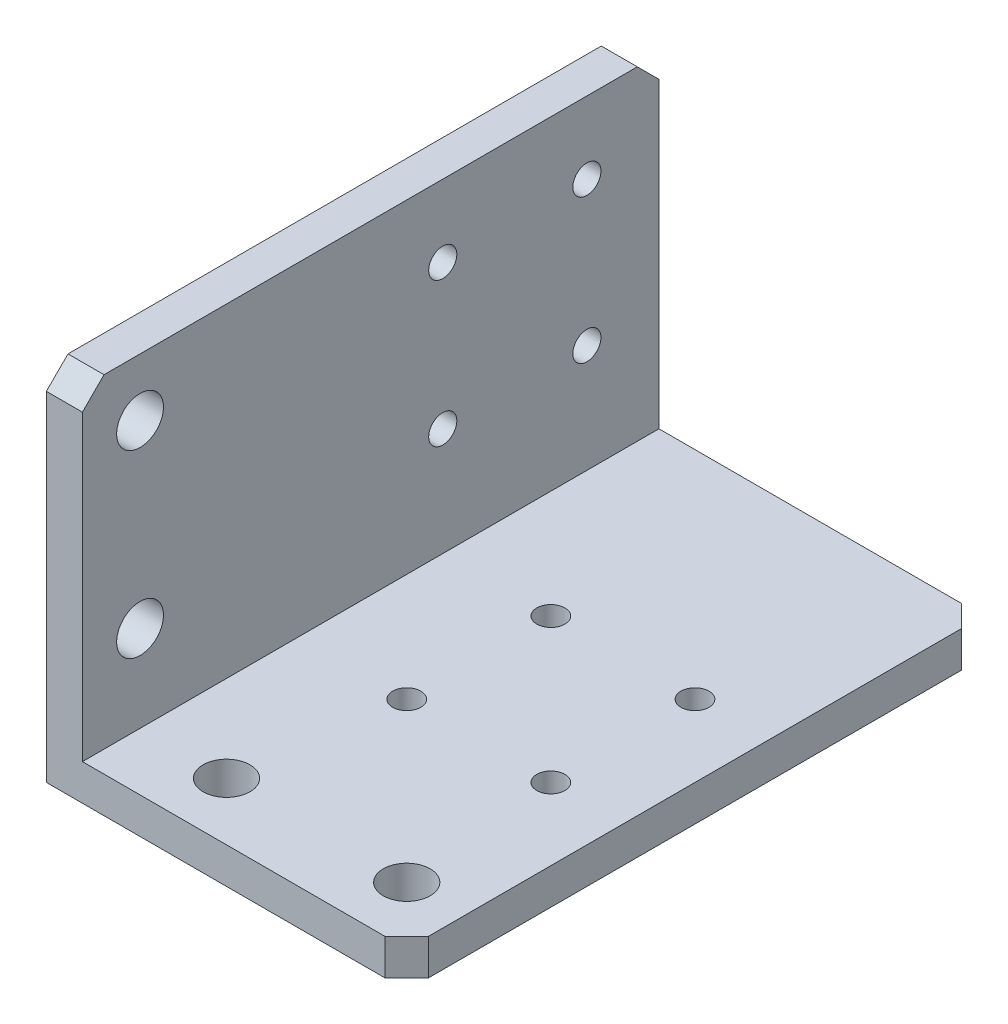
ISO-10303-21;
HEADER;
FILE_DESCRIPTION(('STEP AP214'),'2;1');
FILE_NAME('part.step','',(''),(''),'','','');
FILE_SCHEMA(('AUTOMOTIVE_DESIGN { 1 0 10303 214 1 1 1 1 }'));
ENDSEC;
DATA;
#1=APPLICATION_CONTEXT('core data for automotive mechanical design processes');
#2=APPLICATION_PROTOCOL_DEFINITION('international standard','automotive_design',2000,#1);
#3=PRODUCT_CONTEXT('',#1,'mechanical');
#4=PRODUCT('Part','Part','',(#3));
#5=PRODUCT_RELATED_PRODUCT_CATEGORY('part','',(#4));
#6=PRODUCT_DEFINITION_FORMATION('','',#4);
#7=PRODUCT_DEFINITION_CONTEXT('part definition',#1,'design');
#8=PRODUCT_DEFINITION('design','',#6,#7);
#9=PRODUCT_DEFINITION_SHAPE('','',#8);
#10=(LENGTH_UNIT() NAMED_UNIT(*) SI_UNIT(.MILLI.,.METRE.));
#11=(NAMED_UNIT(*) PLANE_ANGLE_UNIT() SI_UNIT($,.RADIAN.));
#12=(NAMED_UNIT(*) SI_UNIT($,.STERADIAN.) SOLID_ANGLE_UNIT());
#13=UNCERTAINTY_MEASURE_WITH_UNIT(LENGTH_MEASURE(1.E-05),#10,'distance_accuracy_value','');
#14=(GEOMETRIC_REPRESENTATION_CONTEXT(3) GLOBAL_UNCERTAINTY_ASSIGNED_CONTEXT((#13)) GLOBAL_UNIT_ASSIGNED_CONTEXT((#10,
#11,#12)) REPRESENTATION_CONTEXT('',''));
#15=CARTESIAN_POINT('',(0.,0.,0.));
#16=DIRECTION('',(0.,0.,1.));
#17=DIRECTION('',(1.,0.,0.));
#18=AXIS2_PLACEMENT_3D('',#15,#16,#17);
#19=CARTESIAN_POINT('',(50.,0.,80.));
#20=DIRECTION('',(0.,1.,0.));
#21=DIRECTION('',(-1.,0.,0.));
#22=AXIS2_PLACEMENT_3D('',#19,#20,#21);
#23=PLANE('',#22);
#24=CARTESIAN_POINT('',(19.9999999999998,0.,49.9999999999998));
#25=DIRECTION('',(0.,-1.,0.));
#26=DIRECTION('',(0.,0.,-1.));
#27=AXIS2_PLACEMENT_3D('',#24,#25,#26);
#28=CIRCLE('',#27,1.94999999999999);
#29=CARTESIAN_POINT('',(19.9999999999998,0.,48.0499999999999));
#30=VERTEX_POINT('',#29);
#31=EDGE_CURVE('E576',#30,#30,#28,.T.);
#32=ORIENTED_EDGE('',*,*,#31,.F.);
#33=EDGE_LOOP('',(#32));
#34=FACE_BOUND('',#33,.T.);
#35=CARTESIAN_POINT('',(39.9999999999999,0.,50.0000000000001));
#36=DIRECTION('',(0.,-1.,0.));
#37=DIRECTION('',(0.,0.,-1.));
#38=AXIS2_PLACEMENT_3D('',#35,#36,#37);
#39=CIRCLE('',#38,1.94999999999999);
#40=CARTESIAN_POINT('',(39.9999999999999,0.,48.0500000000001));
#41=VERTEX_POINT('',#40);
#42=EDGE_CURVE('E570',#41,#41,#39,.T.);
#43=ORIENTED_EDGE('',*,*,#42,.F.);
#44=EDGE_LOOP('',(#43));
#45=FACE_BOUND('',#44,.T.);
#46=CARTESIAN_POINT('',(40.0000000000001,0.,30.0000000000001));
#47=DIRECTION('',(0.,-1.,0.));
#48=DIRECTION('',(0.,0.,-1.));
#49=AXIS2_PLACEMENT_3D('',#46,#47,#48);
#50=CIRCLE('',#49,1.94999999999999);
#51=CARTESIAN_POINT('',(40.0000000000001,0.,28.0500000000001));
#52=VERTEX_POINT('',#51);
#53=EDGE_CURVE('E564',#52,#52,#50,.T.);
#54=ORIENTED_EDGE('',*,*,#53,.F.);
#55=EDGE_LOOP('',(#54));
#56=FACE_BOUND('',#55,.T.);
#57=CARTESIAN_POINT('',(20.0000000000002,0.,29.9999999999998));
#58=DIRECTION('',(0.,-1.,0.));
#59=DIRECTION('',(0.,0.,-1.));
#60=AXIS2_PLACEMENT_3D('',#57,#58,#59);
#61=CIRCLE('',#60,1.94999999999999);
#62=CARTESIAN_POINT('',(20.0000000000002,0.,28.0499999999998));
#63=VERTEX_POINT('',#62);
#64=EDGE_CURVE('E558',#63,#63,#61,.T.);
#65=ORIENTED_EDGE('',*,*,#64,.F.);
#66=EDGE_LOOP('',(#65));
#67=FACE_BOUND('',#66,.T.);
#68=CARTESIAN_POINT('',(17.,0.,72.));
#69=DIRECTION('',(0.,-1.,0.));
#70=DIRECTION('',(0.,0.,-1.));
#71=AXIS2_PLACEMENT_3D('',#68,#69,#70);
#72=CIRCLE('',#71,3.24999999999999);
#73=CARTESIAN_POINT('',(17.,0.,68.75));
#74=VERTEX_POINT('',#73);
#75=EDGE_CURVE('E223',#74,#74,#72,.T.);
#76=ORIENTED_EDGE('',*,*,#75,.F.);
#77=EDGE_LOOP('',(#76));
#78=FACE_BOUND('',#77,.T.);
#79=CARTESIAN_POINT('',(42.,0.,72.));
#80=DIRECTION('',(0.,-1.,0.));
#81=DIRECTION('',(0.,0.,-1.));
#82=AXIS2_PLACEMENT_3D('',#79,#80,#81);
#83=CIRCLE('',#82,3.24999999999999);
#84=CARTESIAN_POINT('',(42.,0.,68.75));
#85=VERTEX_POINT('',#84);
#86=EDGE_CURVE('E237',#85,#85,#83,.T.);
#87=ORIENTED_EDGE('',*,*,#86,.F.);
#88=EDGE_LOOP('',(#87));
#89=FACE_BOUND('',#88,.T.);
#90=DIRECTION('',(1.,0.,0.));
#91=VECTOR('',#90,1.);
#92=CARTESIAN_POINT('',(50.,0.,0.));
#93=LINE('',#92,#91);
#94=CARTESIAN_POINT('',(0.,0.,0.));
#95=VERTEX_POINT('',#94);
#96=CARTESIAN_POINT('',(47.,0.,0.));
#97=VERTEX_POINT('',#96);
#98=EDGE_CURVE('E154',#95,#97,#93,.T.);
#99=ORIENTED_EDGE('',*,*,#98,.T.);
#100=DIRECTION('',(0.707106781186548,0.,0.707106781186548));
#101=VECTOR('',#100,1.);
#102=CARTESIAN_POINT('',(50.,0.,3.00000000000002));
#103=LINE('',#102,#101);
#104=CARTESIAN_POINT('',(50.,0.,3.00000000000004));
#105=VERTEX_POINT('',#104);
#106=EDGE_CURVE('E267',#97,#105,#103,.T.);
#107=ORIENTED_EDGE('',*,*,#106,.T.);
#108=DIRECTION('',(0.,0.,-1.));
#109=VECTOR('',#108,1.);
#110=CARTESIAN_POINT('',(50.,0.,80.));
#111=LINE('',#110,#109);
#112=CARTESIAN_POINT('',(50.,0.,77.));
#113=VERTEX_POINT('',#112);
#114=EDGE_CURVE('E256',#113,#105,#111,.T.);
#115=ORIENTED_EDGE('',*,*,#114,.F.);
#116=DIRECTION('',(0.707106781186544,0.,-0.707106781186551));
#117=VECTOR('',#116,1.);
#118=CARTESIAN_POINT('',(47.,0.,80.));
#119=LINE('',#118,#117);
#120=CARTESIAN_POINT('',(47.,0.,80.));
#121=VERTEX_POINT('',#120);
#122=EDGE_CURVE('E57',#113,#121,#119,.F.);
#123=ORIENTED_EDGE('',*,*,#122,.T.);
#124=DIRECTION('',(1.,0.,0.));
#125=VECTOR('',#124,1.);
#126=CARTESIAN_POINT('',(50.,0.,80.));
#127=LINE('',#126,#125);
#128=CARTESIAN_POINT('',(0.,0.,80.));
#129=VERTEX_POINT('',#128);
#130=EDGE_CURVE('E129',#129,#121,#127,.T.);
#131=ORIENTED_EDGE('',*,*,#130,.F.);
#132=DIRECTION('',(0.,0.,-1.));
#133=VECTOR('',#132,1.);
#134=CARTESIAN_POINT('',(0.,0.,80.));
#135=LINE('',#134,#133);
#136=EDGE_CURVE('E150',#129,#95,#135,.T.);
#137=ORIENTED_EDGE('',*,*,#136,.T.);
#138=EDGE_LOOP('',(#99,#107,#115,#123,#131,#137));
#139=FACE_BOUND('',#138,.T.);
#140=ADVANCED_FACE('F41',(#34,#45,#56,#67,#78,#89,#139),#23,.F.);
#141=CARTESIAN_POINT('',(50.,5.,80.));
#142=DIRECTION('',(-1.,0.,0.));
#143=DIRECTION('',(0.,0.,1.));
#144=AXIS2_PLACEMENT_3D('',#141,#142,#143);
#145=PLANE('',#144);
#146=ORIENTED_EDGE('',*,*,#114,.T.);
#147=DIRECTION('',(0.,1.,0.));
#148=VECTOR('',#147,1.);
#149=CARTESIAN_POINT('',(50.,5.,3.00000000000002));
#150=LINE('',#149,#148);
#151=CARTESIAN_POINT('',(50.,5.,3.00000000000004));
#152=VERTEX_POINT('',#151);
#153=EDGE_CURVE('E279',#105,#152,#150,.T.);
#154=ORIENTED_EDGE('',*,*,#153,.T.);
#155=DIRECTION('',(0.,0.,-1.));
#156=VECTOR('',#155,1.);
#157=CARTESIAN_POINT('',(50.,5.,80.));
#158=LINE('',#157,#156);
#159=CARTESIAN_POINT('',(50.,5.,77.));
#160=VERTEX_POINT('',#159);
#161=EDGE_CURVE('E140',#160,#152,#158,.T.);
#162=ORIENTED_EDGE('',*,*,#161,.F.);
#163=DIRECTION('',(0.,-1.,0.));
#164=VECTOR('',#163,1.);
#165=CARTESIAN_POINT('',(50.,5.,77.));
#166=LINE('',#165,#164);
#167=EDGE_CURVE('E282',#160,#113,#166,.T.);
#168=ORIENTED_EDGE('',*,*,#167,.T.);
#169=EDGE_LOOP('',(#146,#154,#162,#168));
#170=FACE_BOUND('',#169,.T.);
#171=ADVANCED_FACE('F303',(#170),#145,.F.);
#172=CARTESIAN_POINT('',(5.00000000000001,5.,80.));
#173=DIRECTION('',(0.,-1.,0.));
#174=DIRECTION('',(1.,0.,0.));
#175=AXIS2_PLACEMENT_3D('',#172,#173,#174);
#176=PLANE('',#175);
#177=CARTESIAN_POINT('',(19.9999999999998,5.,49.9999999999998));
#178=DIRECTION('',(0.,-1.,0.));
#179=DIRECTION('',(1.,0.,0.));
#180=AXIS2_PLACEMENT_3D('',#177,#178,#179);
#181=CIRCLE('',#180,1.94999999999999);
#182=CARTESIAN_POINT('',(21.9499999999998,5.,49.9999999999998));
#183=VERTEX_POINT('',#182);
#184=EDGE_CURVE('E573',#183,#183,#181,.T.);
#185=ORIENTED_EDGE('',*,*,#184,.T.);
#186=EDGE_LOOP('',(#185));
#187=FACE_BOUND('',#186,.T.);
#188=CARTESIAN_POINT('',(39.9999999999999,5.,50.0000000000001));
#189=DIRECTION('',(0.,-1.,0.));
#190=DIRECTION('',(1.,0.,0.));
#191=AXIS2_PLACEMENT_3D('',#188,#189,#190);
#192=CIRCLE('',#191,1.94999999999999);
#193=CARTESIAN_POINT('',(41.9499999999999,5.,50.0000000000001));
#194=VERTEX_POINT('',#193);
#195=EDGE_CURVE('E567',#194,#194,#192,.T.);
#196=ORIENTED_EDGE('',*,*,#195,.T.);
#197=EDGE_LOOP('',(#196));
#198=FACE_BOUND('',#197,.T.);
#199=CARTESIAN_POINT('',(40.0000000000001,5.,30.0000000000001));
#200=DIRECTION('',(0.,-1.,0.));
#201=DIRECTION('',(1.,0.,0.));
#202=AXIS2_PLACEMENT_3D('',#199,#200,#201);
#203=CIRCLE('',#202,1.94999999999999);
#204=CARTESIAN_POINT('',(41.9500000000001,5.,30.0000000000001));
#205=VERTEX_POINT('',#204);
#206=EDGE_CURVE('E561',#205,#205,#203,.T.);
#207=ORIENTED_EDGE('',*,*,#206,.T.);
#208=EDGE_LOOP('',(#207));
#209=FACE_BOUND('',#208,.T.);
#210=CARTESIAN_POINT('',(20.0000000000002,5.,29.9999999999998));
#211=DIRECTION('',(0.,-1.,0.));
#212=DIRECTION('',(1.,0.,0.));
#213=AXIS2_PLACEMENT_3D('',#210,#211,#212);
#214=CIRCLE('',#213,1.94999999999999);
#215=CARTESIAN_POINT('',(21.9500000000002,5.,29.9999999999998));
#216=VERTEX_POINT('',#215);
#217=EDGE_CURVE('E45',#216,#216,#214,.T.);
#218=ORIENTED_EDGE('',*,*,#217,.T.);
#219=EDGE_LOOP('',(#218));
#220=FACE_BOUND('',#219,.T.);
#221=CARTESIAN_POINT('',(17.,5.,72.));
#222=DIRECTION('',(0.,-1.,0.));
#223=DIRECTION('',(1.,0.,0.));
#224=AXIS2_PLACEMENT_3D('',#221,#222,#223);
#225=CIRCLE('',#224,3.24999999999999);
#226=CARTESIAN_POINT('',(20.25,5.,72.));
#227=VERTEX_POINT('',#226);
#228=EDGE_CURVE('E229',#227,#227,#225,.T.);
#229=ORIENTED_EDGE('',*,*,#228,.T.);
#230=EDGE_LOOP('',(#229));
#231=FACE_BOUND('',#230,.T.);
#232=CARTESIAN_POINT('',(42.,5.,72.));
#233=DIRECTION('',(0.,-1.,0.));
#234=DIRECTION('',(1.,0.,0.));
#235=AXIS2_PLACEMENT_3D('',#232,#233,#234);
#236=CIRCLE('',#235,3.24999999999999);
#237=CARTESIAN_POINT('',(45.25,5.,72.));
#238=VERTEX_POINT('',#237);
#239=EDGE_CURVE('E242',#238,#238,#236,.T.);
#240=ORIENTED_EDGE('',*,*,#239,.T.);
#241=EDGE_LOOP('',(#240));
#242=FACE_BOUND('',#241,.T.);
#243=ORIENTED_EDGE('',*,*,#161,.T.);
#244=DIRECTION('',(-0.707106781186548,0.,-0.707106781186548));
#245=VECTOR('',#244,1.);
#246=CARTESIAN_POINT('',(50.,5.,3.00000000000002));
#247=LINE('',#246,#245);
#248=CARTESIAN_POINT('',(47.,5.,0.));
#249=VERTEX_POINT('',#248);
#250=EDGE_CURVE('E276',#152,#249,#247,.T.);
#251=ORIENTED_EDGE('',*,*,#250,.T.);
#252=DIRECTION('',(-1.,0.,0.));
#253=VECTOR('',#252,1.);
#254=CARTESIAN_POINT('',(5.00000000000001,5.,0.));
#255=LINE('',#254,#253);
#256=CARTESIAN_POINT('',(5.00000000000001,5.,0.));
#257=VERTEX_POINT('',#256);
#258=EDGE_CURVE('E136',#249,#257,#255,.T.);
#259=ORIENTED_EDGE('',*,*,#258,.T.);
#260=DIRECTION('',(0.,0.,-1.));
#261=VECTOR('',#260,1.);
#262=CARTESIAN_POINT('',(5.00000000000001,5.,80.));
#263=LINE('',#262,#261);
#264=CARTESIAN_POINT('',(5.00000000000001,5.,80.));
#265=VERTEX_POINT('',#264);
#266=EDGE_CURVE('E132',#265,#257,#263,.T.);
#267=ORIENTED_EDGE('',*,*,#266,.F.);
#268=DIRECTION('',(-1.,0.,0.));
#269=VECTOR('',#268,1.);
#270=CARTESIAN_POINT('',(5.00000000000001,5.,80.));
#271=LINE('',#270,#269);
#272=CARTESIAN_POINT('',(47.,5.,80.));
#273=VERTEX_POINT('',#272);
#274=EDGE_CURVE('E122',#273,#265,#271,.T.);
#275=ORIENTED_EDGE('',*,*,#274,.F.);
#276=DIRECTION('',(-0.707106781186544,0.,0.707106781186551));
#277=VECTOR('',#276,1.);
#278=CARTESIAN_POINT('',(47.,5.,80.));
#279=LINE('',#278,#277);
#280=EDGE_CURVE('E65',#273,#160,#279,.F.);
#281=ORIENTED_EDGE('',*,*,#280,.T.);
#282=EDGE_LOOP('',(#243,#251,#259,#267,#275,#281));
#283=FACE_BOUND('',#282,.T.);
#284=ADVANCED_FACE('F134',(#187,#198,#209,#220,#231,#242,#283),#176,.F.);
#285=CARTESIAN_POINT('',(5.,50.,80.));
#286=DIRECTION('',(-1.,0.,0.));
#287=DIRECTION('',(0.,-1.,0.));
#288=AXIS2_PLACEMENT_3D('',#285,#286,#287);
#289=PLANE('',#288);
#290=CARTESIAN_POINT('',(5.,40.,10.));
#291=DIRECTION('',(-1.,0.,0.));
#292=DIRECTION('',(0.,-1.,0.));
#293=AXIS2_PLACEMENT_3D('',#290,#291,#292);
#294=CIRCLE('',#293,1.94999999999999);
#295=CARTESIAN_POINT('',(5.,38.05,10.));
#296=VERTEX_POINT('',#295);
#297=EDGE_CURVE('E552',#296,#296,#294,.T.);
#298=ORIENTED_EDGE('',*,*,#297,.T.);
#299=EDGE_LOOP('',(#298));
#300=FACE_BOUND('',#299,.T.);
#301=CARTESIAN_POINT('',(5.,40.,30.));
#302=DIRECTION('',(-1.,0.,0.));
#303=DIRECTION('',(0.,-1.,0.));
#304=AXIS2_PLACEMENT_3D('',#301,#302,#303);
#305=CIRCLE('',#304,1.94999999999999);
#306=CARTESIAN_POINT('',(5.,38.05,30.));
#307=VERTEX_POINT('',#306);
#308=EDGE_CURVE('E546',#307,#307,#305,.T.);
#309=ORIENTED_EDGE('',*,*,#308,.T.);
#310=EDGE_LOOP('',(#309));
#311=FACE_BOUND('',#310,.T.);
#312=CARTESIAN_POINT('',(5.00000000000001,20.,30.));
#313=DIRECTION('',(-1.,0.,0.));
#314=DIRECTION('',(0.,-1.,0.));
#315=AXIS2_PLACEMENT_3D('',#312,#313,#314);
#316=CIRCLE('',#315,1.94999999999999);
#317=CARTESIAN_POINT('',(5.00000000000001,18.0500000000001,30.));
#318=VERTEX_POINT('',#317);
#319=EDGE_CURVE('E540',#318,#318,#316,.T.);
#320=ORIENTED_EDGE('',*,*,#319,.T.);
#321=EDGE_LOOP('',(#320));
#322=FACE_BOUND('',#321,.T.);
#323=CARTESIAN_POINT('',(5.00000000000001,20.,10.0000000000001));
#324=DIRECTION('',(-1.,0.,0.));
#325=DIRECTION('',(0.,-1.,0.));
#326=AXIS2_PLACEMENT_3D('',#323,#324,#325);
#327=CIRCLE('',#326,1.94999999999999);
#328=CARTESIAN_POINT('',(5.00000000000001,18.05,10.0000000000001));
#329=VERTEX_POINT('',#328);
#330=EDGE_CURVE('E516',#329,#329,#327,.T.);
#331=ORIENTED_EDGE('',*,*,#330,.T.);
#332=EDGE_LOOP('',(#331));
#333=FACE_BOUND('',#332,.T.);
#334=CARTESIAN_POINT('',(5.,42.,72.));
#335=DIRECTION('',(-1.,0.,0.));
#336=DIRECTION('',(0.,0.,1.));
#337=AXIS2_PLACEMENT_3D('',#334,#335,#336);
#338=CIRCLE('',#337,3.25);
#339=CARTESIAN_POINT('',(5.,42.,75.25));
#340=VERTEX_POINT('',#339);
#341=EDGE_CURVE('E515',#340,#340,#338,.T.);
#342=ORIENTED_EDGE('',*,*,#341,.T.);
#343=EDGE_LOOP('',(#342));
#344=FACE_BOUND('',#343,.T.);
#345=CARTESIAN_POINT('',(5.,17.,72.));
#346=DIRECTION('',(-1.,0.,0.));
#347=DIRECTION('',(0.,0.,1.));
#348=AXIS2_PLACEMENT_3D('',#345,#346,#347);
#349=CIRCLE('',#348,3.25);
#350=CARTESIAN_POINT('',(5.,17.,75.25));
#351=VERTEX_POINT('',#350);
#352=EDGE_CURVE('E230',#351,#351,#349,.T.);
#353=ORIENTED_EDGE('',*,*,#352,.T.);
#354=EDGE_LOOP('',(#353));
#355=FACE_BOUND('',#354,.T.);
#356=DIRECTION('',(0.,1.,0.));
#357=VECTOR('',#356,1.);
#358=CARTESIAN_POINT('',(5.,50.,0.));
#359=LINE('',#358,#357);
#360=CARTESIAN_POINT('',(5.,47.,0.));
#361=VERTEX_POINT('',#360);
#362=EDGE_CURVE('E215',#257,#361,#359,.T.);
#363=ORIENTED_EDGE('',*,*,#362,.T.);
#364=DIRECTION('',(0.,0.707106781186548,0.707106781186548));
#365=VECTOR('',#364,1.);
#366=CARTESIAN_POINT('',(5.,50.,3.00000000000002));
#367=LINE('',#366,#365);
#368=CARTESIAN_POINT('',(5.,50.,3.00000000000004));
#369=VERTEX_POINT('',#368);
#370=EDGE_CURVE('E284',#361,#369,#367,.T.);
#371=ORIENTED_EDGE('',*,*,#370,.T.);
#372=DIRECTION('',(0.,0.,-1.));
#373=VECTOR('',#372,1.);
#374=CARTESIAN_POINT('',(5.,50.,80.));
#375=LINE('',#374,#373);
#376=CARTESIAN_POINT('',(5.,50.,77.));
#377=VERTEX_POINT('',#376);
#378=EDGE_CURVE('E141',#377,#369,#375,.T.);
#379=ORIENTED_EDGE('',*,*,#378,.F.);
#380=DIRECTION('',(0.,0.707106781186544,-0.707106781186551));
#381=VECTOR('',#380,1.);
#382=CARTESIAN_POINT('',(5.,47.,80.));
#383=LINE('',#382,#381);
#384=CARTESIAN_POINT('',(5.,47.,80.));
#385=VERTEX_POINT('',#384);
#386=EDGE_CURVE('E146',#377,#385,#383,.F.);
#387=ORIENTED_EDGE('',*,*,#386,.T.);
#388=DIRECTION('',(0.,1.,0.));
#389=VECTOR('',#388,1.);
#390=CARTESIAN_POINT('',(5.,50.,80.));
#391=LINE('',#390,#389);
#392=EDGE_CURVE('E126',#265,#385,#391,.T.);
#393=ORIENTED_EDGE('',*,*,#392,.F.);
#394=ORIENTED_EDGE('',*,*,#266,.T.);
#395=EDGE_LOOP('',(#363,#371,#379,#387,#393,#394));
#396=FACE_BOUND('',#395,.T.);
#397=ADVANCED_FACE('F143',(#300,#311,#322,#333,#344,#355,#396),#289,.F.);
#398=CARTESIAN_POINT('',(0.,50.,80.));
#399=DIRECTION('',(0.,-1.,0.));
#400=DIRECTION('',(0.,0.,-1.));
#401=AXIS2_PLACEMENT_3D('',#398,#399,#400);
#402=PLANE('',#401);
#403=ORIENTED_EDGE('',*,*,#378,.T.);
#404=DIRECTION('',(-1.,0.,0.));
#405=VECTOR('',#404,1.);
#406=CARTESIAN_POINT('',(0.,50.,3.00000000000002));
#407=LINE('',#406,#405);
#408=CARTESIAN_POINT('',(0.,50.,3.00000000000004));
#409=VERTEX_POINT('',#408);
#410=EDGE_CURVE('E505',#369,#409,#407,.T.);
#411=ORIENTED_EDGE('',*,*,#410,.T.);
#412=DIRECTION('',(0.,0.,-1.));
#413=VECTOR('',#412,1.);
#414=CARTESIAN_POINT('',(0.,50.,80.));
#415=LINE('',#414,#413);
#416=CARTESIAN_POINT('',(0.,50.,77.));
#417=VERTEX_POINT('',#416);
#418=EDGE_CURVE('E195',#417,#409,#415,.T.);
#419=ORIENTED_EDGE('',*,*,#418,.F.);
#420=DIRECTION('',(1.,0.,0.));
#421=VECTOR('',#420,1.);
#422=CARTESIAN_POINT('',(0.,50.,77.));
#423=LINE('',#422,#421);
#424=EDGE_CURVE('E262',#417,#377,#423,.T.);
#425=ORIENTED_EDGE('',*,*,#424,.T.);
#426=EDGE_LOOP('',(#403,#411,#419,#425));
#427=FACE_BOUND('',#426,.T.);
#428=ADVANCED_FACE('F355',(#427),#402,.F.);
#429=CARTESIAN_POINT('',(0.,0.,80.));
#430=DIRECTION('',(1.,0.,0.));
#431=DIRECTION('',(0.,0.,-1.));
#432=AXIS2_PLACEMENT_3D('',#429,#430,#431);
#433=PLANE('',#432);
#434=CARTESIAN_POINT('',(0.,40.,10.));
#435=DIRECTION('',(-1.,0.,0.));
#436=DIRECTION('',(0.,0.,1.));
#437=AXIS2_PLACEMENT_3D('',#434,#435,#436);
#438=CIRCLE('',#437,1.94999999999999);
#439=CARTESIAN_POINT('',(0.,40.,11.95));
#440=VERTEX_POINT('',#439);
#441=EDGE_CURVE('E555',#440,#440,#438,.T.);
#442=ORIENTED_EDGE('',*,*,#441,.F.);
#443=EDGE_LOOP('',(#442));
#444=FACE_BOUND('',#443,.T.);
#445=CARTESIAN_POINT('',(0.,40.,30.));
#446=DIRECTION('',(-1.,0.,0.));
#447=DIRECTION('',(0.,0.,1.));
#448=AXIS2_PLACEMENT_3D('',#445,#446,#447);
#449=CIRCLE('',#448,1.94999999999999);
#450=CARTESIAN_POINT('',(0.,40.,31.9499999999999));
#451=VERTEX_POINT('',#450);
#452=EDGE_CURVE('E549',#451,#451,#449,.T.);
#453=ORIENTED_EDGE('',*,*,#452,.F.);
#454=EDGE_LOOP('',(#453));
#455=FACE_BOUND('',#454,.T.);
#456=CARTESIAN_POINT('',(0.,20.,30.));
#457=DIRECTION('',(-1.,0.,0.));
#458=DIRECTION('',(0.,0.,1.));
#459=AXIS2_PLACEMENT_3D('',#456,#457,#458);
#460=CIRCLE('',#459,1.94999999999999);
#461=CARTESIAN_POINT('',(0.,20.,31.95));
#462=VERTEX_POINT('',#461);
#463=EDGE_CURVE('E543',#462,#462,#460,.T.);
#464=ORIENTED_EDGE('',*,*,#463,.F.);
#465=EDGE_LOOP('',(#464));
#466=FACE_BOUND('',#465,.T.);
#467=CARTESIAN_POINT('',(0.,20.,10.0000000000001));
#468=DIRECTION('',(-1.,0.,0.));
#469=DIRECTION('',(0.,0.,1.));
#470=AXIS2_PLACEMENT_3D('',#467,#468,#469);
#471=CIRCLE('',#470,1.94999999999999);
#472=CARTESIAN_POINT('',(0.,20.,11.9500000000001));
#473=VERTEX_POINT('',#472);
#474=EDGE_CURVE('E537',#473,#473,#471,.T.);
#475=ORIENTED_EDGE('',*,*,#474,.F.);
#476=EDGE_LOOP('',(#475));
#477=FACE_BOUND('',#476,.T.);
#478=CARTESIAN_POINT('',(0.,42.,72.));
#479=DIRECTION('',(-1.,0.,0.));
#480=DIRECTION('',(0.,0.,1.));
#481=AXIS2_PLACEMENT_3D('',#478,#479,#480);
#482=CIRCLE('',#481,3.24999999999999);
#483=CARTESIAN_POINT('',(0.,42.,75.25));
#484=VERTEX_POINT('',#483);
#485=EDGE_CURVE('E512',#484,#484,#482,.T.);
#486=ORIENTED_EDGE('',*,*,#485,.F.);
#487=EDGE_LOOP('',(#486));
#488=FACE_BOUND('',#487,.T.);
#489=CARTESIAN_POINT('',(0.,17.,72.));
#490=DIRECTION('',(-1.,0.,0.));
#491=DIRECTION('',(0.,0.,1.));
#492=AXIS2_PLACEMENT_3D('',#489,#490,#491);
#493=CIRCLE('',#492,3.24999999999999);
#494=CARTESIAN_POINT('',(0.,17.,75.25));
#495=VERTEX_POINT('',#494);
#496=EDGE_CURVE('E517',#495,#495,#493,.T.);
#497=ORIENTED_EDGE('',*,*,#496,.F.);
#498=EDGE_LOOP('',(#497));
#499=FACE_BOUND('',#498,.T.);
#500=ORIENTED_EDGE('',*,*,#418,.T.);
#501=DIRECTION('',(0.,-0.707106781186548,-0.707106781186548));
#502=VECTOR('',#501,1.);
#503=CARTESIAN_POINT('',(0.,50.,3.00000000000002));
#504=LINE('',#503,#502);
#505=CARTESIAN_POINT('',(0.,47.,0.));
#506=VERTEX_POINT('',#505);
#507=EDGE_CURVE('E176',#409,#506,#504,.T.);
#508=ORIENTED_EDGE('',*,*,#507,.T.);
#509=DIRECTION('',(0.,-1.,0.));
#510=VECTOR('',#509,1.);
#511=CARTESIAN_POINT('',(0.,0.,0.));
#512=LINE('',#511,#510);
#513=EDGE_CURVE('E211',#506,#95,#512,.T.);
#514=ORIENTED_EDGE('',*,*,#513,.T.);
#515=ORIENTED_EDGE('',*,*,#136,.F.);
#516=DIRECTION('',(0.,-1.,0.));
#517=VECTOR('',#516,1.);
#518=CARTESIAN_POINT('',(0.,0.,80.));
#519=LINE('',#518,#517);
#520=CARTESIAN_POINT('',(0.,47.,80.));
#521=VERTEX_POINT('',#520);
#522=EDGE_CURVE('E147',#521,#129,#519,.T.);
#523=ORIENTED_EDGE('',*,*,#522,.F.);
#524=DIRECTION('',(0.,-0.707106781186544,0.707106781186551));
#525=VECTOR('',#524,1.);
#526=CARTESIAN_POINT('',(0.,47.,80.));
#527=LINE('',#526,#525);
#528=EDGE_CURVE('E182',#521,#417,#527,.F.);
#529=ORIENTED_EDGE('',*,*,#528,.T.);
#530=EDGE_LOOP('',(#500,#508,#514,#515,#523,#529));
#531=FACE_BOUND('',#530,.T.);
#532=ADVANCED_FACE('F365',(#444,#455,#466,#477,#488,#499,#531),#433,.F.);
#533=CARTESIAN_POINT('',(0.,0.,80.));
#534=DIRECTION('',(0.,0.,-1.));
#535=DIRECTION('',(-1.,0.,0.));
#536=AXIS2_PLACEMENT_3D('',#533,#534,#535);
#537=PLANE('',#536);
#538=ORIENTED_EDGE('',*,*,#392,.T.);
#539=DIRECTION('',(-1.,0.,0.));
#540=VECTOR('',#539,1.);
#541=CARTESIAN_POINT('',(0.,47.,80.));
#542=LINE('',#541,#540);
#543=EDGE_CURVE('E12',#385,#521,#542,.T.);
#544=ORIENTED_EDGE('',*,*,#543,.T.);
#545=ORIENTED_EDGE('',*,*,#522,.T.);
#546=ORIENTED_EDGE('',*,*,#130,.T.);
#547=DIRECTION('',(0.,1.,0.));
#548=VECTOR('',#547,1.);
#549=CARTESIAN_POINT('',(47.,0.,80.));
#550=LINE('',#549,#548);
#551=EDGE_CURVE('E50',#121,#273,#550,.T.);
#552=ORIENTED_EDGE('',*,*,#551,.T.);
#553=ORIENTED_EDGE('',*,*,#274,.T.);
#554=EDGE_LOOP('',(#538,#544,#545,#546,#552,#553));
#555=FACE_BOUND('',#554,.T.);
#556=ADVANCED_FACE('F124',(#555),#537,.F.);
#557=CARTESIAN_POINT('',(0.,0.,0.));
#558=DIRECTION('',(0.,0.,-1.));
#559=DIRECTION('',(-1.,0.,0.));
#560=AXIS2_PLACEMENT_3D('',#557,#558,#559);
#561=PLANE('',#560);
#562=ORIENTED_EDGE('',*,*,#513,.F.);
#563=DIRECTION('',(1.,0.,0.));
#564=VECTOR('',#563,1.);
#565=CARTESIAN_POINT('',(5.,47.,0.));
#566=LINE('',#565,#564);
#567=EDGE_CURVE('E286',#506,#361,#566,.T.);
#568=ORIENTED_EDGE('',*,*,#567,.T.);
#569=ORIENTED_EDGE('',*,*,#362,.F.);
#570=ORIENTED_EDGE('',*,*,#258,.F.);
#571=DIRECTION('',(0.,-1.,0.));
#572=VECTOR('',#571,1.);
#573=CARTESIAN_POINT('',(47.,0.,0.));
#574=LINE('',#573,#572);
#575=EDGE_CURVE('E181',#249,#97,#574,.T.);
#576=ORIENTED_EDGE('',*,*,#575,.T.);
#577=ORIENTED_EDGE('',*,*,#98,.F.);
#578=EDGE_LOOP('',(#562,#568,#569,#570,#576,#577));
#579=FACE_BOUND('',#578,.T.);
#580=ADVANCED_FACE('F293',(#579),#561,.T.);
#581=CARTESIAN_POINT('',(42.,0.,72.));
#582=DIRECTION('',(0.,-1.,0.));
#583=DIRECTION('',(0.,0.,-1.));
#584=AXIS2_PLACEMENT_3D('',#581,#582,#583);
#585=CYLINDRICAL_SURFACE('',#584,3.24999999999999);
#586=ORIENTED_EDGE('',*,*,#86,.T.);
#587=EDGE_LOOP('',(#586));
#588=FACE_BOUND('',#587,.T.);
#589=ORIENTED_EDGE('',*,*,#239,.F.);
#590=EDGE_LOOP('',(#589));
#591=FACE_BOUND('',#590,.T.);
#592=ADVANCED_FACE('F490',(#588,#591),#585,.F.);
#593=CARTESIAN_POINT('',(17.,0.,72.));
#594=DIRECTION('',(0.,-1.,0.));
#595=DIRECTION('',(0.,0.,-1.));
#596=AXIS2_PLACEMENT_3D('',#593,#594,#595);
#597=CYLINDRICAL_SURFACE('',#596,3.24999999999999);
#598=ORIENTED_EDGE('',*,*,#75,.T.);
#599=EDGE_LOOP('',(#598));
#600=FACE_BOUND('',#599,.T.);
#601=ORIENTED_EDGE('',*,*,#228,.F.);
#602=EDGE_LOOP('',(#601));
#603=FACE_BOUND('',#602,.T.);
#604=ADVANCED_FACE('F486',(#600,#603),#597,.F.);
#605=CARTESIAN_POINT('',(0.,17.,72.));
#606=DIRECTION('',(-1.,0.,0.));
#607=DIRECTION('',(0.,0.,1.));
#608=AXIS2_PLACEMENT_3D('',#605,#606,#607);
#609=CYLINDRICAL_SURFACE('',#608,3.24999999999999);
#610=ORIENTED_EDGE('',*,*,#352,.F.);
#611=EDGE_LOOP('',(#610));
#612=FACE_BOUND('',#611,.T.);
#613=ORIENTED_EDGE('',*,*,#496,.T.);
#614=EDGE_LOOP('',(#613));
#615=FACE_BOUND('',#614,.T.);
#616=ADVANCED_FACE('F482',(#612,#615),#609,.F.);
#617=CARTESIAN_POINT('',(0.,42.,72.));
#618=DIRECTION('',(-1.,0.,0.));
#619=DIRECTION('',(0.,0.,1.));
#620=AXIS2_PLACEMENT_3D('',#617,#618,#619);
#621=CYLINDRICAL_SURFACE('',#620,3.24999999999999);
#622=ORIENTED_EDGE('',*,*,#341,.F.);
#623=EDGE_LOOP('',(#622));
#624=FACE_BOUND('',#623,.T.);
#625=ORIENTED_EDGE('',*,*,#485,.T.);
#626=EDGE_LOOP('',(#625));
#627=FACE_BOUND('',#626,.T.);
#628=ADVANCED_FACE('F329',(#624,#627),#621,.F.);
#629=CARTESIAN_POINT('',(0.,50.,3.00000000000002));
#630=DIRECTION('',(0.,0.707106781186548,-0.707106781186548));
#631=DIRECTION('',(1.,0.,0.));
#632=AXIS2_PLACEMENT_3D('',#629,#630,#631);
#633=PLANE('',#632);
#634=ORIENTED_EDGE('',*,*,#370,.F.);
#635=ORIENTED_EDGE('',*,*,#567,.F.);
#636=ORIENTED_EDGE('',*,*,#507,.F.);
#637=ORIENTED_EDGE('',*,*,#410,.F.);
#638=EDGE_LOOP('',(#634,#635,#636,#637));
#639=FACE_BOUND('',#638,.T.);
#640=ADVANCED_FACE('F326',(#639),#633,.T.);
#641=CARTESIAN_POINT('',(50.,5.,3.00000000000002));
#642=DIRECTION('',(0.707106781186548,0.,-0.707106781186548));
#643=DIRECTION('',(0.,-1.,0.));
#644=AXIS2_PLACEMENT_3D('',#641,#642,#643);
#645=PLANE('',#644);
#646=ORIENTED_EDGE('',*,*,#106,.F.);
#647=ORIENTED_EDGE('',*,*,#575,.F.);
#648=ORIENTED_EDGE('',*,*,#250,.F.);
#649=ORIENTED_EDGE('',*,*,#153,.F.);
#650=EDGE_LOOP('',(#646,#647,#648,#649));
#651=FACE_BOUND('',#650,.T.);
#652=ADVANCED_FACE('F300',(#651),#645,.T.);
#653=CARTESIAN_POINT('',(0.,47.,80.));
#654=DIRECTION('',(0.,-0.707106781186551,-0.707106781186544));
#655=DIRECTION('',(-1.,0.,0.));
#656=AXIS2_PLACEMENT_3D('',#653,#654,#655);
#657=PLANE('',#656);
#658=ORIENTED_EDGE('',*,*,#386,.F.);
#659=ORIENTED_EDGE('',*,*,#424,.F.);
#660=ORIENTED_EDGE('',*,*,#528,.F.);
#661=ORIENTED_EDGE('',*,*,#543,.F.);
#662=EDGE_LOOP('',(#658,#659,#660,#661));
#663=FACE_BOUND('',#662,.T.);
#664=ADVANCED_FACE('F306',(#663),#657,.F.);
#665=CARTESIAN_POINT('',(47.,0.,80.));
#666=DIRECTION('',(-0.707106781186551,0.,-0.707106781186544));
#667=DIRECTION('',(0.,1.,0.));
#668=AXIS2_PLACEMENT_3D('',#665,#666,#667);
#669=PLANE('',#668);
#670=ORIENTED_EDGE('',*,*,#122,.F.);
#671=ORIENTED_EDGE('',*,*,#167,.F.);
#672=ORIENTED_EDGE('',*,*,#280,.F.);
#673=ORIENTED_EDGE('',*,*,#551,.F.);
#674=EDGE_LOOP('',(#670,#671,#672,#673));
#675=FACE_BOUND('',#674,.T.);
#676=ADVANCED_FACE('F43',(#675),#669,.F.);
#677=CARTESIAN_POINT('',(0.,20.,10.0000000000001));
#678=DIRECTION('',(-1.,0.,0.));
#679=DIRECTION('',(0.,0.,1.));
#680=AXIS2_PLACEMENT_3D('',#677,#678,#679);
#681=CYLINDRICAL_SURFACE('',#680,1.94999999999999);
#682=ORIENTED_EDGE('',*,*,#474,.T.);
#683=EDGE_LOOP('',(#682));
#684=FACE_BOUND('',#683,.T.);
#685=ORIENTED_EDGE('',*,*,#330,.F.);
#686=EDGE_LOOP('',(#685));
#687=FACE_BOUND('',#686,.T.);
#688=ADVANCED_FACE('F305',(#684,#687),#681,.F.);
#689=CARTESIAN_POINT('',(0.,20.,30.));
#690=DIRECTION('',(-1.,0.,0.));
#691=DIRECTION('',(0.,0.,1.));
#692=AXIS2_PLACEMENT_3D('',#689,#690,#691);
#693=CYLINDRICAL_SURFACE('',#692,1.94999999999999);
#694=ORIENTED_EDGE('',*,*,#463,.T.);
#695=EDGE_LOOP('',(#694));
#696=FACE_BOUND('',#695,.T.);
#697=ORIENTED_EDGE('',*,*,#319,.F.);
#698=EDGE_LOOP('',(#697));
#699=FACE_BOUND('',#698,.T.);
#700=ADVANCED_FACE('F311',(#696,#699),#693,.F.);
#701=CARTESIAN_POINT('',(0.,40.,30.));
#702=DIRECTION('',(-1.,0.,0.));
#703=DIRECTION('',(0.,0.,1.));
#704=AXIS2_PLACEMENT_3D('',#701,#702,#703);
#705=CYLINDRICAL_SURFACE('',#704,1.94999999999999);
#706=ORIENTED_EDGE('',*,*,#452,.T.);
#707=EDGE_LOOP('',(#706));
#708=FACE_BOUND('',#707,.T.);
#709=ORIENTED_EDGE('',*,*,#308,.F.);
#710=EDGE_LOOP('',(#709));
#711=FACE_BOUND('',#710,.T.);
#712=ADVANCED_FACE('F389',(#708,#711),#705,.F.);
#713=CARTESIAN_POINT('',(0.,40.,10.));
#714=DIRECTION('',(-1.,0.,0.));
#715=DIRECTION('',(0.,0.,1.));
#716=AXIS2_PLACEMENT_3D('',#713,#714,#715);
#717=CYLINDRICAL_SURFACE('',#716,1.94999999999999);
#718=ORIENTED_EDGE('',*,*,#441,.T.);
#719=EDGE_LOOP('',(#718));
#720=FACE_BOUND('',#719,.T.);
#721=ORIENTED_EDGE('',*,*,#297,.F.);
#722=EDGE_LOOP('',(#721));
#723=FACE_BOUND('',#722,.T.);
#724=ADVANCED_FACE('F400',(#720,#723),#717,.F.);
#725=CARTESIAN_POINT('',(20.0000000000002,0.,29.9999999999998));
#726=DIRECTION('',(0.,-1.,0.));
#727=DIRECTION('',(0.,0.,-1.));
#728=AXIS2_PLACEMENT_3D('',#725,#726,#727);
#729=CYLINDRICAL_SURFACE('',#728,1.94999999999999);
#730=ORIENTED_EDGE('',*,*,#64,.T.);
#731=EDGE_LOOP('',(#730));
#732=FACE_BOUND('',#731,.T.);
#733=ORIENTED_EDGE('',*,*,#217,.F.);
#734=EDGE_LOOP('',(#733));
#735=FACE_BOUND('',#734,.T.);
#736=ADVANCED_FACE('F411',(#732,#735),#729,.F.);
#737=CARTESIAN_POINT('',(40.0000000000001,0.,30.0000000000001));
#738=DIRECTION('',(0.,-1.,0.));
#739=DIRECTION('',(0.,0.,-1.));
#740=AXIS2_PLACEMENT_3D('',#737,#738,#739);
#741=CYLINDRICAL_SURFACE('',#740,1.94999999999999);
#742=ORIENTED_EDGE('',*,*,#53,.T.);
#743=EDGE_LOOP('',(#742));
#744=FACE_BOUND('',#743,.T.);
#745=ORIENTED_EDGE('',*,*,#206,.F.);
#746=EDGE_LOOP('',(#745));
#747=FACE_BOUND('',#746,.T.);
#748=ADVANCED_FACE('F434',(#744,#747),#741,.F.);
#749=CARTESIAN_POINT('',(39.9999999999999,0.,50.0000000000001));
#750=DIRECTION('',(0.,-1.,0.));
#751=DIRECTION('',(0.,0.,-1.));
#752=AXIS2_PLACEMENT_3D('',#749,#750,#751);
#753=CYLINDRICAL_SURFACE('',#752,1.94999999999999);
#754=ORIENTED_EDGE('',*,*,#42,.T.);
#755=EDGE_LOOP('',(#754));
#756=FACE_BOUND('',#755,.T.);
#757=ORIENTED_EDGE('',*,*,#195,.F.);
#758=EDGE_LOOP('',(#757));
#759=FACE_BOUND('',#758,.T.);
#760=ADVANCED_FACE('F445',(#756,#759),#753,.F.);
#761=CARTESIAN_POINT('',(19.9999999999998,0.,49.9999999999998));
#762=DIRECTION('',(0.,-1.,0.));
#763=DIRECTION('',(0.,0.,-1.));
#764=AXIS2_PLACEMENT_3D('',#761,#762,#763);
#765=CYLINDRICAL_SURFACE('',#764,1.94999999999999);
#766=ORIENTED_EDGE('',*,*,#31,.T.);
#767=EDGE_LOOP('',(#766));
#768=FACE_BOUND('',#767,.T.);
#769=ORIENTED_EDGE('',*,*,#184,.F.);
#770=EDGE_LOOP('',(#769));
#771=FACE_BOUND('',#770,.T.);
#772=ADVANCED_FACE('F456',(#768,#771),#765,.F.);
#773=CLOSED_SHELL('',(#140,#171,#284,#397,#428,#532,#556,#580,#592,#604,#616,#628,#640,#652,
#664,#676,#688,#700,#712,#724,#736,#748,#760,#772));
#774=MANIFOLD_SOLID_BREP('B2',#773);
#775=ADVANCED_BREP_SHAPE_REPRESENTATION('',(#18,#774),#14);
#776=SHAPE_DEFINITION_REPRESENTATION(#9,#775);
ENDSEC;
END-ISO-10303-21;
